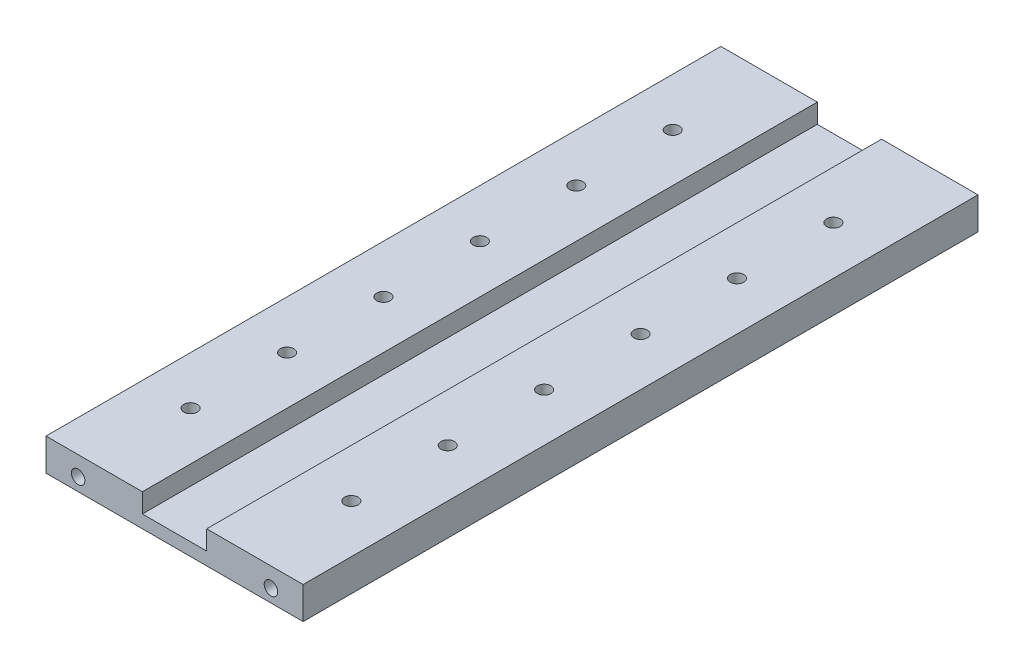
ISO-10303-21;
HEADER;
FILE_DESCRIPTION(('STEP AP214'),'2;1');
FILE_NAME('part.step','',(''),(''),'','','');
FILE_SCHEMA(('AUTOMOTIVE_DESIGN { 1 0 10303 214 1 1 1 1 }'));
ENDSEC;
DATA;
#1=APPLICATION_CONTEXT('core data for automotive mechanical design processes');
#2=APPLICATION_PROTOCOL_DEFINITION('international standard','automotive_design',2000,#1);
#3=PRODUCT_CONTEXT('',#1,'mechanical');
#4=PRODUCT('Part','Part','',(#3));
#5=PRODUCT_RELATED_PRODUCT_CATEGORY('part','',(#4));
#6=PRODUCT_DEFINITION_FORMATION('','',#4);
#7=PRODUCT_DEFINITION_CONTEXT('part definition',#1,'design');
#8=PRODUCT_DEFINITION('design','',#6,#7);
#9=PRODUCT_DEFINITION_SHAPE('','',#8);
#10=(LENGTH_UNIT() NAMED_UNIT(*) SI_UNIT(.MILLI.,.METRE.));
#11=(NAMED_UNIT(*) PLANE_ANGLE_UNIT() SI_UNIT($,.RADIAN.));
#12=(NAMED_UNIT(*) SI_UNIT($,.STERADIAN.) SOLID_ANGLE_UNIT());
#13=UNCERTAINTY_MEASURE_WITH_UNIT(LENGTH_MEASURE(1.E-05),#10,'distance_accuracy_value','');
#14=(GEOMETRIC_REPRESENTATION_CONTEXT(3) GLOBAL_UNCERTAINTY_ASSIGNED_CONTEXT((#13)) GLOBAL_UNIT_ASSIGNED_CONTEXT((#10,
#11,#12)) REPRESENTATION_CONTEXT('',''));
#15=CARTESIAN_POINT('',(0.,0.,0.));
#16=DIRECTION('',(0.,0.,1.));
#17=DIRECTION('',(1.,0.,0.));
#18=AXIS2_PLACEMENT_3D('',#15,#16,#17);
#19=CARTESIAN_POINT('',(-40.,10.,105.));
#20=DIRECTION('',(1.,0.,0.));
#21=DIRECTION('',(0.,0.,-1.));
#22=AXIS2_PLACEMENT_3D('',#19,#20,#21);
#23=PLANE('',#22);
#24=DIRECTION('',(0.,-1.,0.));
#25=VECTOR('',#24,1.);
#26=CARTESIAN_POINT('',(-40.,10.,-105.));
#27=LINE('',#26,#25);
#28=CARTESIAN_POINT('',(-40.,10.,-105.));
#29=VERTEX_POINT('',#28);
#30=CARTESIAN_POINT('',(-40.,0.,-105.));
#31=VERTEX_POINT('',#30);
#32=EDGE_CURVE('E137',#29,#31,#27,.T.);
#33=ORIENTED_EDGE('',*,*,#32,.T.);
#34=DIRECTION('',(0.,0.,-1.));
#35=VECTOR('',#34,1.);
#36=CARTESIAN_POINT('',(-40.,0.,105.));
#37=LINE('',#36,#35);
#38=CARTESIAN_POINT('',(-40.,0.,105.));
#39=VERTEX_POINT('',#38);
#40=EDGE_CURVE('E11',#39,#31,#37,.T.);
#41=ORIENTED_EDGE('',*,*,#40,.F.);
#42=DIRECTION('',(0.,-1.,0.));
#43=VECTOR('',#42,1.);
#44=CARTESIAN_POINT('',(-40.,10.,105.));
#45=LINE('',#44,#43);
#46=CARTESIAN_POINT('',(-40.,10.,105.));
#47=VERTEX_POINT('',#46);
#48=EDGE_CURVE('E152',#47,#39,#45,.T.);
#49=ORIENTED_EDGE('',*,*,#48,.F.);
#50=DIRECTION('',(0.,0.,-1.));
#51=VECTOR('',#50,1.);
#52=CARTESIAN_POINT('',(-40.,10.,105.));
#53=LINE('',#52,#51);
#54=EDGE_CURVE('E133',#47,#29,#53,.T.);
#55=ORIENTED_EDGE('',*,*,#54,.T.);
#56=EDGE_LOOP('',(#33,#41,#49,#55));
#57=FACE_BOUND('',#56,.T.);
#58=ADVANCED_FACE('F38',(#57),#23,.F.);
#59=CARTESIAN_POINT('',(-40.,0.,105.));
#60=DIRECTION('',(0.,1.,0.));
#61=DIRECTION('',(-1.,0.,0.));
#62=AXIS2_PLACEMENT_3D('',#59,#60,#61);
#63=PLANE('',#62);
#64=CARTESIAN_POINT('',(-25.,0.,75.));
#65=DIRECTION('',(0.,1.,0.));
#66=DIRECTION('',(0.,0.,1.));
#67=AXIS2_PLACEMENT_3D('',#64,#65,#66);
#68=CIRCLE('',#67,2.1);
#69=CARTESIAN_POINT('',(-25.,0.,77.1));
#70=VERTEX_POINT('',#69);
#71=EDGE_CURVE('E274',#70,#70,#68,.T.);
#72=ORIENTED_EDGE('',*,*,#71,.T.);
#73=EDGE_LOOP('',(#72));
#74=FACE_BOUND('',#73,.T.);
#75=CARTESIAN_POINT('',(-25.,0.,45.));
#76=DIRECTION('',(0.,1.,0.));
#77=DIRECTION('',(0.,0.,1.));
#78=AXIS2_PLACEMENT_3D('',#75,#76,#77);
#79=CIRCLE('',#78,2.1);
#80=CARTESIAN_POINT('',(-25.,0.,47.1));
#81=VERTEX_POINT('',#80);
#82=EDGE_CURVE('E268',#81,#81,#79,.T.);
#83=ORIENTED_EDGE('',*,*,#82,.T.);
#84=EDGE_LOOP('',(#83));
#85=FACE_BOUND('',#84,.T.);
#86=CARTESIAN_POINT('',(-25.,0.,15.));
#87=DIRECTION('',(0.,1.,0.));
#88=DIRECTION('',(0.,0.,1.));
#89=AXIS2_PLACEMENT_3D('',#86,#87,#88);
#90=CIRCLE('',#89,2.1);
#91=CARTESIAN_POINT('',(-25.,0.,17.1));
#92=VERTEX_POINT('',#91);
#93=EDGE_CURVE('E262',#92,#92,#90,.T.);
#94=ORIENTED_EDGE('',*,*,#93,.T.);
#95=EDGE_LOOP('',(#94));
#96=FACE_BOUND('',#95,.T.);
#97=CARTESIAN_POINT('',(-25.,0.,-15.));
#98=DIRECTION('',(0.,1.,0.));
#99=DIRECTION('',(0.,0.,1.));
#100=AXIS2_PLACEMENT_3D('',#97,#98,#99);
#101=CIRCLE('',#100,2.1);
#102=CARTESIAN_POINT('',(-25.,0.,-12.9));
#103=VERTEX_POINT('',#102);
#104=EDGE_CURVE('E256',#103,#103,#101,.T.);
#105=ORIENTED_EDGE('',*,*,#104,.T.);
#106=EDGE_LOOP('',(#105));
#107=FACE_BOUND('',#106,.T.);
#108=CARTESIAN_POINT('',(-25.,0.,-45.));
#109=DIRECTION('',(0.,1.,0.));
#110=DIRECTION('',(0.,0.,1.));
#111=AXIS2_PLACEMENT_3D('',#108,#109,#110);
#112=CIRCLE('',#111,2.1);
#113=CARTESIAN_POINT('',(-25.,0.,-42.9));
#114=VERTEX_POINT('',#113);
#115=EDGE_CURVE('E250',#114,#114,#112,.T.);
#116=ORIENTED_EDGE('',*,*,#115,.T.);
#117=EDGE_LOOP('',(#116));
#118=FACE_BOUND('',#117,.T.);
#119=CARTESIAN_POINT('',(-25.,0.,-75.));
#120=DIRECTION('',(0.,1.,0.));
#121=DIRECTION('',(0.,0.,1.));
#122=AXIS2_PLACEMENT_3D('',#119,#120,#121);
#123=CIRCLE('',#122,2.1);
#124=CARTESIAN_POINT('',(-25.,0.,-72.9));
#125=VERTEX_POINT('',#124);
#126=EDGE_CURVE('E244',#125,#125,#123,.T.);
#127=ORIENTED_EDGE('',*,*,#126,.T.);
#128=EDGE_LOOP('',(#127));
#129=FACE_BOUND('',#128,.T.);
#130=CARTESIAN_POINT('',(25.,0.,-75.));
#131=DIRECTION('',(0.,1.,0.));
#132=DIRECTION('',(0.,0.,1.));
#133=AXIS2_PLACEMENT_3D('',#130,#131,#132);
#134=CIRCLE('',#133,2.1);
#135=CARTESIAN_POINT('',(25.,0.,-72.9));
#136=VERTEX_POINT('',#135);
#137=EDGE_CURVE('E238',#136,#136,#134,.T.);
#138=ORIENTED_EDGE('',*,*,#137,.T.);
#139=EDGE_LOOP('',(#138));
#140=FACE_BOUND('',#139,.T.);
#141=CARTESIAN_POINT('',(25.,0.,-45.));
#142=DIRECTION('',(0.,1.,0.));
#143=DIRECTION('',(0.,0.,1.));
#144=AXIS2_PLACEMENT_3D('',#141,#142,#143);
#145=CIRCLE('',#144,2.1);
#146=CARTESIAN_POINT('',(25.,0.,-42.9));
#147=VERTEX_POINT('',#146);
#148=EDGE_CURVE('E232',#147,#147,#145,.T.);
#149=ORIENTED_EDGE('',*,*,#148,.T.);
#150=EDGE_LOOP('',(#149));
#151=FACE_BOUND('',#150,.T.);
#152=CARTESIAN_POINT('',(25.,0.,-15.));
#153=DIRECTION('',(0.,1.,0.));
#154=DIRECTION('',(0.,0.,1.));
#155=AXIS2_PLACEMENT_3D('',#152,#153,#154);
#156=CIRCLE('',#155,2.1);
#157=CARTESIAN_POINT('',(25.,0.,-12.9));
#158=VERTEX_POINT('',#157);
#159=EDGE_CURVE('E226',#158,#158,#156,.T.);
#160=ORIENTED_EDGE('',*,*,#159,.T.);
#161=EDGE_LOOP('',(#160));
#162=FACE_BOUND('',#161,.T.);
#163=CARTESIAN_POINT('',(25.,0.,15.));
#164=DIRECTION('',(0.,1.,0.));
#165=DIRECTION('',(0.,0.,1.));
#166=AXIS2_PLACEMENT_3D('',#163,#164,#165);
#167=CIRCLE('',#166,2.1);
#168=CARTESIAN_POINT('',(25.,0.,17.1));
#169=VERTEX_POINT('',#168);
#170=EDGE_CURVE('E220',#169,#169,#167,.T.);
#171=ORIENTED_EDGE('',*,*,#170,.T.);
#172=EDGE_LOOP('',(#171));
#173=FACE_BOUND('',#172,.T.);
#174=CARTESIAN_POINT('',(25.,0.,45.));
#175=DIRECTION('',(0.,1.,0.));
#176=DIRECTION('',(0.,0.,1.));
#177=AXIS2_PLACEMENT_3D('',#174,#175,#176);
#178=CIRCLE('',#177,2.1);
#179=CARTESIAN_POINT('',(25.,0.,47.1));
#180=VERTEX_POINT('',#179);
#181=EDGE_CURVE('E214',#180,#180,#178,.T.);
#182=ORIENTED_EDGE('',*,*,#181,.T.);
#183=EDGE_LOOP('',(#182));
#184=FACE_BOUND('',#183,.T.);
#185=CARTESIAN_POINT('',(25.,0.,75.));
#186=DIRECTION('',(0.,1.,0.));
#187=DIRECTION('',(0.,0.,1.));
#188=AXIS2_PLACEMENT_3D('',#185,#186,#187);
#189=CIRCLE('',#188,2.1);
#190=CARTESIAN_POINT('',(25.,0.,77.1));
#191=VERTEX_POINT('',#190);
#192=EDGE_CURVE('E208',#191,#191,#189,.T.);
#193=ORIENTED_EDGE('',*,*,#192,.T.);
#194=EDGE_LOOP('',(#193));
#195=FACE_BOUND('',#194,.T.);
#196=DIRECTION('',(1.,0.,0.));
#197=VECTOR('',#196,1.);
#198=CARTESIAN_POINT('',(-40.,0.,-105.));
#199=LINE('',#198,#197);
#200=CARTESIAN_POINT('',(40.,0.,-105.));
#201=VERTEX_POINT('',#200);
#202=EDGE_CURVE('E140',#31,#201,#199,.T.);
#203=ORIENTED_EDGE('',*,*,#202,.T.);
#204=DIRECTION('',(0.,0.,-1.));
#205=VECTOR('',#204,1.);
#206=CARTESIAN_POINT('',(40.,0.,105.));
#207=LINE('',#206,#205);
#208=CARTESIAN_POINT('',(40.,0.,105.));
#209=VERTEX_POINT('',#208);
#210=EDGE_CURVE('E46',#209,#201,#207,.T.);
#211=ORIENTED_EDGE('',*,*,#210,.F.);
#212=DIRECTION('',(1.,0.,0.));
#213=VECTOR('',#212,1.);
#214=CARTESIAN_POINT('',(-40.,0.,105.));
#215=LINE('',#214,#213);
#216=EDGE_CURVE('E98',#39,#209,#215,.T.);
#217=ORIENTED_EDGE('',*,*,#216,.F.);
#218=ORIENTED_EDGE('',*,*,#40,.T.);
#219=EDGE_LOOP('',(#203,#211,#217,#218));
#220=FACE_BOUND('',#219,.T.);
#221=ADVANCED_FACE('F315',(#74,#85,#96,#107,#118,#129,#140,#151,#162,#173,#184,#195,#220),#63,.F.);
#222=CARTESIAN_POINT('',(40.,0.,105.));
#223=DIRECTION('',(-1.,0.,0.));
#224=DIRECTION('',(0.,0.,1.));
#225=AXIS2_PLACEMENT_3D('',#222,#223,#224);
#226=PLANE('',#225);
#227=DIRECTION('',(0.,1.,0.));
#228=VECTOR('',#227,1.);
#229=CARTESIAN_POINT('',(40.,0.,-105.));
#230=LINE('',#229,#228);
#231=CARTESIAN_POINT('',(40.,10.,-105.));
#232=VERTEX_POINT('',#231);
#233=EDGE_CURVE('E143',#201,#232,#230,.T.);
#234=ORIENTED_EDGE('',*,*,#233,.T.);
#235=DIRECTION('',(0.,0.,-1.));
#236=VECTOR('',#235,1.);
#237=CARTESIAN_POINT('',(40.,10.,105.));
#238=LINE('',#237,#236);
#239=CARTESIAN_POINT('',(40.,10.,105.));
#240=VERTEX_POINT('',#239);
#241=EDGE_CURVE('E159',#240,#232,#238,.T.);
#242=ORIENTED_EDGE('',*,*,#241,.F.);
#243=DIRECTION('',(0.,1.,0.));
#244=VECTOR('',#243,1.);
#245=CARTESIAN_POINT('',(40.,0.,105.));
#246=LINE('',#245,#244);
#247=EDGE_CURVE('E167',#209,#240,#246,.T.);
#248=ORIENTED_EDGE('',*,*,#247,.F.);
#249=ORIENTED_EDGE('',*,*,#210,.T.);
#250=EDGE_LOOP('',(#234,#242,#248,#249));
#251=FACE_BOUND('',#250,.T.);
#252=ADVANCED_FACE('F165',(#251),#226,.F.);
#253=CARTESIAN_POINT('',(40.,10.,105.));
#254=DIRECTION('',(0.,-1.,0.));
#255=DIRECTION('',(1.,0.,0.));
#256=AXIS2_PLACEMENT_3D('',#253,#254,#255);
#257=PLANE('',#256);
#258=CARTESIAN_POINT('',(25.,10.,-75.));
#259=DIRECTION('',(0.,1.,0.));
#260=DIRECTION('',(0.,0.,1.));
#261=AXIS2_PLACEMENT_3D('',#258,#259,#260);
#262=CIRCLE('',#261,2.09999999999999);
#263=CARTESIAN_POINT('',(25.,10.,-72.9));
#264=VERTEX_POINT('',#263);
#265=EDGE_CURVE('E241',#264,#264,#262,.T.);
#266=ORIENTED_EDGE('',*,*,#265,.F.);
#267=EDGE_LOOP('',(#266));
#268=FACE_BOUND('',#267,.T.);
#269=CARTESIAN_POINT('',(25.,10.,-45.));
#270=DIRECTION('',(0.,1.,0.));
#271=DIRECTION('',(0.,0.,1.));
#272=AXIS2_PLACEMENT_3D('',#269,#270,#271);
#273=CIRCLE('',#272,2.09999999999999);
#274=CARTESIAN_POINT('',(25.,10.,-42.9));
#275=VERTEX_POINT('',#274);
#276=EDGE_CURVE('E235',#275,#275,#273,.T.);
#277=ORIENTED_EDGE('',*,*,#276,.F.);
#278=EDGE_LOOP('',(#277));
#279=FACE_BOUND('',#278,.T.);
#280=CARTESIAN_POINT('',(25.,10.,-15.));
#281=DIRECTION('',(0.,1.,0.));
#282=DIRECTION('',(0.,0.,1.));
#283=AXIS2_PLACEMENT_3D('',#280,#281,#282);
#284=CIRCLE('',#283,2.09999999999999);
#285=CARTESIAN_POINT('',(25.,10.,-12.9));
#286=VERTEX_POINT('',#285);
#287=EDGE_CURVE('E229',#286,#286,#284,.T.);
#288=ORIENTED_EDGE('',*,*,#287,.F.);
#289=EDGE_LOOP('',(#288));
#290=FACE_BOUND('',#289,.T.);
#291=CARTESIAN_POINT('',(25.,10.,15.));
#292=DIRECTION('',(0.,1.,0.));
#293=DIRECTION('',(0.,0.,1.));
#294=AXIS2_PLACEMENT_3D('',#291,#292,#293);
#295=CIRCLE('',#294,2.09999999999999);
#296=CARTESIAN_POINT('',(25.,10.,17.1));
#297=VERTEX_POINT('',#296);
#298=EDGE_CURVE('E223',#297,#297,#295,.T.);
#299=ORIENTED_EDGE('',*,*,#298,.F.);
#300=EDGE_LOOP('',(#299));
#301=FACE_BOUND('',#300,.T.);
#302=CARTESIAN_POINT('',(25.,10.,45.));
#303=DIRECTION('',(0.,1.,0.));
#304=DIRECTION('',(0.,0.,1.));
#305=AXIS2_PLACEMENT_3D('',#302,#303,#304);
#306=CIRCLE('',#305,2.09999999999999);
#307=CARTESIAN_POINT('',(25.,10.,47.1));
#308=VERTEX_POINT('',#307);
#309=EDGE_CURVE('E217',#308,#308,#306,.T.);
#310=ORIENTED_EDGE('',*,*,#309,.F.);
#311=EDGE_LOOP('',(#310));
#312=FACE_BOUND('',#311,.T.);
#313=CARTESIAN_POINT('',(25.,10.,75.));
#314=DIRECTION('',(0.,1.,0.));
#315=DIRECTION('',(0.,0.,1.));
#316=AXIS2_PLACEMENT_3D('',#313,#314,#315);
#317=CIRCLE('',#316,2.09999999999999);
#318=CARTESIAN_POINT('',(25.,10.,77.1));
#319=VERTEX_POINT('',#318);
#320=EDGE_CURVE('E211',#319,#319,#317,.T.);
#321=ORIENTED_EDGE('',*,*,#320,.F.);
#322=EDGE_LOOP('',(#321));
#323=FACE_BOUND('',#322,.T.);
#324=DIRECTION('',(-1.,0.,0.));
#325=VECTOR('',#324,1.);
#326=CARTESIAN_POINT('',(40.,10.,-105.));
#327=LINE('',#326,#325);
#328=CARTESIAN_POINT('',(10.,10.,-105.));
#329=VERTEX_POINT('',#328);
#330=EDGE_CURVE('E145',#232,#329,#327,.T.);
#331=ORIENTED_EDGE('',*,*,#330,.T.);
#332=DIRECTION('',(0.,0.,-1.));
#333=VECTOR('',#332,1.);
#334=CARTESIAN_POINT('',(10.,10.,105.));
#335=LINE('',#334,#333);
#336=CARTESIAN_POINT('',(10.,10.,105.));
#337=VERTEX_POINT('',#336);
#338=EDGE_CURVE('E156',#337,#329,#335,.T.);
#339=ORIENTED_EDGE('',*,*,#338,.F.);
#340=DIRECTION('',(-1.,0.,0.));
#341=VECTOR('',#340,1.);
#342=CARTESIAN_POINT('',(40.,10.,105.));
#343=LINE('',#342,#341);
#344=EDGE_CURVE('E179',#240,#337,#343,.T.);
#345=ORIENTED_EDGE('',*,*,#344,.F.);
#346=ORIENTED_EDGE('',*,*,#241,.T.);
#347=EDGE_LOOP('',(#331,#339,#345,#346));
#348=FACE_BOUND('',#347,.T.);
#349=ADVANCED_FACE('F175',(#268,#279,#290,#301,#312,#323,#348),#257,.F.);
#350=CARTESIAN_POINT('',(10.,10.,105.));
#351=DIRECTION('',(1.,0.,0.));
#352=DIRECTION('',(0.,1.,0.));
#353=AXIS2_PLACEMENT_3D('',#350,#351,#352);
#354=PLANE('',#353);
#355=DIRECTION('',(0.,-1.,0.));
#356=VECTOR('',#355,1.);
#357=CARTESIAN_POINT('',(10.,10.,-105.));
#358=LINE('',#357,#356);
#359=CARTESIAN_POINT('',(10.,4.,-105.));
#360=VERTEX_POINT('',#359);
#361=EDGE_CURVE('E147',#329,#360,#358,.T.);
#362=ORIENTED_EDGE('',*,*,#361,.T.);
#363=DIRECTION('',(0.,0.,-1.));
#364=VECTOR('',#363,1.);
#365=CARTESIAN_POINT('',(10.,4.,105.));
#366=LINE('',#365,#364);
#367=CARTESIAN_POINT('',(10.,4.,105.));
#368=VERTEX_POINT('',#367);
#369=EDGE_CURVE('E128',#368,#360,#366,.T.);
#370=ORIENTED_EDGE('',*,*,#369,.F.);
#371=DIRECTION('',(0.,-1.,0.));
#372=VECTOR('',#371,1.);
#373=CARTESIAN_POINT('',(10.,10.,105.));
#374=LINE('',#373,#372);
#375=EDGE_CURVE('E119',#337,#368,#374,.T.);
#376=ORIENTED_EDGE('',*,*,#375,.F.);
#377=ORIENTED_EDGE('',*,*,#338,.T.);
#378=EDGE_LOOP('',(#362,#370,#376,#377));
#379=FACE_BOUND('',#378,.T.);
#380=ADVANCED_FACE('F178',(#379),#354,.F.);
#381=CARTESIAN_POINT('',(10.,4.,105.));
#382=DIRECTION('',(0.,-1.,0.));
#383=DIRECTION('',(0.,0.,-1.));
#384=AXIS2_PLACEMENT_3D('',#381,#382,#383);
#385=PLANE('',#384);
#386=DIRECTION('',(-1.,0.,0.));
#387=VECTOR('',#386,1.);
#388=CARTESIAN_POINT('',(10.,4.,-105.));
#389=LINE('',#388,#387);
#390=CARTESIAN_POINT('',(-10.,4.,-105.));
#391=VERTEX_POINT('',#390);
#392=EDGE_CURVE('E127',#360,#391,#389,.T.);
#393=ORIENTED_EDGE('',*,*,#392,.T.);
#394=DIRECTION('',(0.,0.,-1.));
#395=VECTOR('',#394,1.);
#396=CARTESIAN_POINT('',(-10.,4.,105.));
#397=LINE('',#396,#395);
#398=CARTESIAN_POINT('',(-10.,4.,105.));
#399=VERTEX_POINT('',#398);
#400=EDGE_CURVE('E124',#399,#391,#397,.T.);
#401=ORIENTED_EDGE('',*,*,#400,.F.);
#402=DIRECTION('',(-1.,0.,0.));
#403=VECTOR('',#402,1.);
#404=CARTESIAN_POINT('',(10.,4.,105.));
#405=LINE('',#404,#403);
#406=EDGE_CURVE('E113',#368,#399,#405,.T.);
#407=ORIENTED_EDGE('',*,*,#406,.F.);
#408=ORIENTED_EDGE('',*,*,#369,.T.);
#409=EDGE_LOOP('',(#393,#401,#407,#408));
#410=FACE_BOUND('',#409,.T.);
#411=ADVANCED_FACE('F125',(#410),#385,.F.);
#412=CARTESIAN_POINT('',(-10.,4.,105.));
#413=DIRECTION('',(-1.,0.,0.));
#414=DIRECTION('',(0.,-1.,0.));
#415=AXIS2_PLACEMENT_3D('',#412,#413,#414);
#416=PLANE('',#415);
#417=DIRECTION('',(0.,1.,0.));
#418=VECTOR('',#417,1.);
#419=CARTESIAN_POINT('',(-10.,4.,-105.));
#420=LINE('',#419,#418);
#421=CARTESIAN_POINT('',(-10.,10.,-105.));
#422=VERTEX_POINT('',#421);
#423=EDGE_CURVE('E84',#391,#422,#420,.T.);
#424=ORIENTED_EDGE('',*,*,#423,.T.);
#425=DIRECTION('',(0.,0.,-1.));
#426=VECTOR('',#425,1.);
#427=CARTESIAN_POINT('',(-10.,10.,105.));
#428=LINE('',#427,#426);
#429=CARTESIAN_POINT('',(-10.,10.,105.));
#430=VERTEX_POINT('',#429);
#431=EDGE_CURVE('E129',#430,#422,#428,.T.);
#432=ORIENTED_EDGE('',*,*,#431,.F.);
#433=DIRECTION('',(0.,1.,0.));
#434=VECTOR('',#433,1.);
#435=CARTESIAN_POINT('',(-10.,4.,105.));
#436=LINE('',#435,#434);
#437=EDGE_CURVE('E117',#399,#430,#436,.T.);
#438=ORIENTED_EDGE('',*,*,#437,.F.);
#439=ORIENTED_EDGE('',*,*,#400,.T.);
#440=EDGE_LOOP('',(#424,#432,#438,#439));
#441=FACE_BOUND('',#440,.T.);
#442=ADVANCED_FACE('F131',(#441),#416,.F.);
#443=CARTESIAN_POINT('',(-10.,10.,105.));
#444=DIRECTION('',(0.,-1.,0.));
#445=DIRECTION('',(1.,0.,0.));
#446=AXIS2_PLACEMENT_3D('',#443,#444,#445);
#447=PLANE('',#446);
#448=CARTESIAN_POINT('',(-25.,10.,75.));
#449=DIRECTION('',(0.,1.,0.));
#450=DIRECTION('',(0.,0.,1.));
#451=AXIS2_PLACEMENT_3D('',#448,#449,#450);
#452=CIRCLE('',#451,2.09999999999999);
#453=CARTESIAN_POINT('',(-25.,10.,77.1));
#454=VERTEX_POINT('',#453);
#455=EDGE_CURVE('E277',#454,#454,#452,.T.);
#456=ORIENTED_EDGE('',*,*,#455,.F.);
#457=EDGE_LOOP('',(#456));
#458=FACE_BOUND('',#457,.T.);
#459=CARTESIAN_POINT('',(-25.,10.,45.));
#460=DIRECTION('',(0.,1.,0.));
#461=DIRECTION('',(0.,0.,1.));
#462=AXIS2_PLACEMENT_3D('',#459,#460,#461);
#463=CIRCLE('',#462,2.09999999999999);
#464=CARTESIAN_POINT('',(-25.,10.,47.1));
#465=VERTEX_POINT('',#464);
#466=EDGE_CURVE('E271',#465,#465,#463,.T.);
#467=ORIENTED_EDGE('',*,*,#466,.F.);
#468=EDGE_LOOP('',(#467));
#469=FACE_BOUND('',#468,.T.);
#470=CARTESIAN_POINT('',(-25.,10.,15.));
#471=DIRECTION('',(0.,1.,0.));
#472=DIRECTION('',(0.,0.,1.));
#473=AXIS2_PLACEMENT_3D('',#470,#471,#472);
#474=CIRCLE('',#473,2.09999999999999);
#475=CARTESIAN_POINT('',(-25.,10.,17.1));
#476=VERTEX_POINT('',#475);
#477=EDGE_CURVE('E265',#476,#476,#474,.T.);
#478=ORIENTED_EDGE('',*,*,#477,.F.);
#479=EDGE_LOOP('',(#478));
#480=FACE_BOUND('',#479,.T.);
#481=CARTESIAN_POINT('',(-25.,10.,-15.));
#482=DIRECTION('',(0.,1.,0.));
#483=DIRECTION('',(0.,0.,1.));
#484=AXIS2_PLACEMENT_3D('',#481,#482,#483);
#485=CIRCLE('',#484,2.09999999999999);
#486=CARTESIAN_POINT('',(-25.,10.,-12.9));
#487=VERTEX_POINT('',#486);
#488=EDGE_CURVE('E259',#487,#487,#485,.T.);
#489=ORIENTED_EDGE('',*,*,#488,.F.);
#490=EDGE_LOOP('',(#489));
#491=FACE_BOUND('',#490,.T.);
#492=CARTESIAN_POINT('',(-25.,10.,-45.));
#493=DIRECTION('',(0.,1.,0.));
#494=DIRECTION('',(0.,0.,1.));
#495=AXIS2_PLACEMENT_3D('',#492,#493,#494);
#496=CIRCLE('',#495,2.09999999999999);
#497=CARTESIAN_POINT('',(-25.,10.,-42.9));
#498=VERTEX_POINT('',#497);
#499=EDGE_CURVE('E253',#498,#498,#496,.T.);
#500=ORIENTED_EDGE('',*,*,#499,.F.);
#501=EDGE_LOOP('',(#500));
#502=FACE_BOUND('',#501,.T.);
#503=CARTESIAN_POINT('',(-25.,10.,-75.));
#504=DIRECTION('',(0.,1.,0.));
#505=DIRECTION('',(0.,0.,1.));
#506=AXIS2_PLACEMENT_3D('',#503,#504,#505);
#507=CIRCLE('',#506,2.09999999999999);
#508=CARTESIAN_POINT('',(-25.,10.,-72.9));
#509=VERTEX_POINT('',#508);
#510=EDGE_CURVE('E247',#509,#509,#507,.T.);
#511=ORIENTED_EDGE('',*,*,#510,.F.);
#512=EDGE_LOOP('',(#511));
#513=FACE_BOUND('',#512,.T.);
#514=DIRECTION('',(-1.,0.,0.));
#515=VECTOR('',#514,1.);
#516=CARTESIAN_POINT('',(-10.,10.,-105.));
#517=LINE('',#516,#515);
#518=EDGE_CURVE('E90',#422,#29,#517,.T.);
#519=ORIENTED_EDGE('',*,*,#518,.T.);
#520=ORIENTED_EDGE('',*,*,#54,.F.);
#521=DIRECTION('',(-1.,0.,0.));
#522=VECTOR('',#521,1.);
#523=CARTESIAN_POINT('',(-10.,10.,105.));
#524=LINE('',#523,#522);
#525=EDGE_CURVE('E54',#430,#47,#524,.T.);
#526=ORIENTED_EDGE('',*,*,#525,.F.);
#527=ORIENTED_EDGE('',*,*,#431,.T.);
#528=EDGE_LOOP('',(#519,#520,#526,#527));
#529=FACE_BOUND('',#528,.T.);
#530=ADVANCED_FACE('F283',(#458,#469,#480,#491,#502,#513,#529),#447,.F.);
#531=CARTESIAN_POINT('',(0.,0.,105.));
#532=DIRECTION('',(0.,0.,1.));
#533=DIRECTION('',(1.,0.,0.));
#534=AXIS2_PLACEMENT_3D('',#531,#532,#533);
#535=PLANE('',#534);
#536=CARTESIAN_POINT('',(-30.,3.99999999999999,105.));
#537=DIRECTION('',(0.,0.,1.));
#538=DIRECTION('',(1.,0.,0.));
#539=AXIS2_PLACEMENT_3D('',#536,#537,#538);
#540=CIRCLE('',#539,2.09999999999999);
#541=CARTESIAN_POINT('',(-27.9,3.99999999999999,105.));
#542=VERTEX_POINT('',#541);
#543=EDGE_CURVE('E193',#542,#542,#540,.T.);
#544=ORIENTED_EDGE('',*,*,#543,.F.);
#545=EDGE_LOOP('',(#544));
#546=FACE_BOUND('',#545,.T.);
#547=CARTESIAN_POINT('',(30.,3.99999999999999,105.));
#548=DIRECTION('',(0.,0.,1.));
#549=DIRECTION('',(1.,0.,0.));
#550=AXIS2_PLACEMENT_3D('',#547,#548,#549);
#551=CIRCLE('',#550,2.09999999999999);
#552=CARTESIAN_POINT('',(32.1,3.99999999999999,105.));
#553=VERTEX_POINT('',#552);
#554=EDGE_CURVE('E187',#553,#553,#551,.T.);
#555=ORIENTED_EDGE('',*,*,#554,.F.);
#556=EDGE_LOOP('',(#555));
#557=FACE_BOUND('',#556,.T.);
#558=ORIENTED_EDGE('',*,*,#48,.T.);
#559=ORIENTED_EDGE('',*,*,#216,.T.);
#560=ORIENTED_EDGE('',*,*,#247,.T.);
#561=ORIENTED_EDGE('',*,*,#344,.T.);
#562=ORIENTED_EDGE('',*,*,#375,.T.);
#563=ORIENTED_EDGE('',*,*,#406,.T.);
#564=ORIENTED_EDGE('',*,*,#437,.T.);
#565=ORIENTED_EDGE('',*,*,#525,.T.);
#566=EDGE_LOOP('',(#558,#559,#560,#561,#562,#563,#564,#565));
#567=FACE_BOUND('',#566,.T.);
#568=ADVANCED_FACE('F115',(#546,#557,#567),#535,.T.);
#569=CARTESIAN_POINT('',(0.,0.,-105.));
#570=DIRECTION('',(0.,0.,1.));
#571=DIRECTION('',(1.,0.,0.));
#572=AXIS2_PLACEMENT_3D('',#569,#570,#571);
#573=PLANE('',#572);
#574=CARTESIAN_POINT('',(25.,5.,-105.));
#575=DIRECTION('',(0.,0.,-1.));
#576=DIRECTION('',(-1.,0.,0.));
#577=AXIS2_PLACEMENT_3D('',#574,#575,#576);
#578=CIRCLE('',#577,2.09999999999999);
#579=CARTESIAN_POINT('',(22.9,5.,-105.));
#580=VERTEX_POINT('',#579);
#581=EDGE_CURVE('E205',#580,#580,#578,.T.);
#582=ORIENTED_EDGE('',*,*,#581,.F.);
#583=EDGE_LOOP('',(#582));
#584=FACE_BOUND('',#583,.T.);
#585=CARTESIAN_POINT('',(-25.,5.,-105.));
#586=DIRECTION('',(0.,0.,-1.));
#587=DIRECTION('',(-1.,0.,0.));
#588=AXIS2_PLACEMENT_3D('',#585,#586,#587);
#589=CIRCLE('',#588,2.09999999999999);
#590=CARTESIAN_POINT('',(-27.1,5.,-105.));
#591=VERTEX_POINT('',#590);
#592=EDGE_CURVE('E199',#591,#591,#589,.T.);
#593=ORIENTED_EDGE('',*,*,#592,.F.);
#594=EDGE_LOOP('',(#593));
#595=FACE_BOUND('',#594,.T.);
#596=ORIENTED_EDGE('',*,*,#32,.F.);
#597=ORIENTED_EDGE('',*,*,#518,.F.);
#598=ORIENTED_EDGE('',*,*,#423,.F.);
#599=ORIENTED_EDGE('',*,*,#392,.F.);
#600=ORIENTED_EDGE('',*,*,#361,.F.);
#601=ORIENTED_EDGE('',*,*,#330,.F.);
#602=ORIENTED_EDGE('',*,*,#233,.F.);
#603=ORIENTED_EDGE('',*,*,#202,.F.);
#604=EDGE_LOOP('',(#596,#597,#598,#599,#600,#601,#602,#603));
#605=FACE_BOUND('',#604,.T.);
#606=ADVANCED_FACE('F171',(#584,#595,#605),#573,.F.);
#607=CARTESIAN_POINT('',(30.,3.99999999999999,91.));
#608=DIRECTION('',(0.,0.,1.));
#609=DIRECTION('',(1.,0.,0.));
#610=AXIS2_PLACEMENT_3D('',#607,#608,#609);
#611=CONICAL_SURFACE('',#610,2.09999999999999,1.02974425867665);
#612=CARTESIAN_POINT('',(30.,3.99999999999999,89.7381927000421));
#613=VERTEX_POINT('',#612);
#614=VERTEX_LOOP('',#613);
#615=FACE_BOUND('',#614,.T.);
#616=CARTESIAN_POINT('',(30.,3.99999999999999,91.));
#617=DIRECTION('',(0.,0.,1.));
#618=DIRECTION('',(1.,0.,0.));
#619=AXIS2_PLACEMENT_3D('',#616,#617,#618);
#620=CIRCLE('',#619,2.09999999999999);
#621=CARTESIAN_POINT('',(32.1,3.99999999999999,91.));
#622=VERTEX_POINT('',#621);
#623=EDGE_CURVE('E141',#622,#622,#620,.T.);
#624=ORIENTED_EDGE('',*,*,#623,.T.);
#625=EDGE_LOOP('',(#624));
#626=FACE_BOUND('',#625,.T.);
#627=ADVANCED_FACE('F340',(#615,#626),#611,.F.);
#628=CARTESIAN_POINT('',(30.,3.99999999999999,105.));
#629=DIRECTION('',(0.,0.,1.));
#630=DIRECTION('',(1.,0.,0.));
#631=AXIS2_PLACEMENT_3D('',#628,#629,#630);
#632=CYLINDRICAL_SURFACE('',#631,2.09999999999999);
#633=ORIENTED_EDGE('',*,*,#623,.F.);
#634=EDGE_LOOP('',(#633));
#635=FACE_BOUND('',#634,.T.);
#636=ORIENTED_EDGE('',*,*,#554,.T.);
#637=EDGE_LOOP('',(#636));
#638=FACE_BOUND('',#637,.T.);
#639=ADVANCED_FACE('F347',(#635,#638),#632,.F.);
#640=CARTESIAN_POINT('',(-30.,3.99999999999999,91.));
#641=DIRECTION('',(0.,0.,1.));
#642=DIRECTION('',(1.,0.,0.));
#643=AXIS2_PLACEMENT_3D('',#640,#641,#642);
#644=CONICAL_SURFACE('',#643,2.09999999999999,1.02974425867665);
#645=CARTESIAN_POINT('',(-30.,3.99999999999999,89.7381927000421));
#646=VERTEX_POINT('',#645);
#647=VERTEX_LOOP('',#646);
#648=FACE_BOUND('',#647,.T.);
#649=CARTESIAN_POINT('',(-30.,3.99999999999999,91.));
#650=DIRECTION('',(0.,0.,1.));
#651=DIRECTION('',(1.,0.,0.));
#652=AXIS2_PLACEMENT_3D('',#649,#650,#651);
#653=CIRCLE('',#652,2.09999999999999);
#654=CARTESIAN_POINT('',(-27.9,3.99999999999999,91.));
#655=VERTEX_POINT('',#654);
#656=EDGE_CURVE('E190',#655,#655,#653,.T.);
#657=ORIENTED_EDGE('',*,*,#656,.T.);
#658=EDGE_LOOP('',(#657));
#659=FACE_BOUND('',#658,.T.);
#660=ADVANCED_FACE('F351',(#648,#659),#644,.F.);
#661=CARTESIAN_POINT('',(-30.,3.99999999999999,105.));
#662=DIRECTION('',(0.,0.,1.));
#663=DIRECTION('',(1.,0.,0.));
#664=AXIS2_PLACEMENT_3D('',#661,#662,#663);
#665=CYLINDRICAL_SURFACE('',#664,2.09999999999999);
#666=ORIENTED_EDGE('',*,*,#656,.F.);
#667=EDGE_LOOP('',(#666));
#668=FACE_BOUND('',#667,.T.);
#669=ORIENTED_EDGE('',*,*,#543,.T.);
#670=EDGE_LOOP('',(#669));
#671=FACE_BOUND('',#670,.T.);
#672=ADVANCED_FACE('F355',(#668,#671),#665,.F.);
#673=CARTESIAN_POINT('',(-25.,5.,-91.));
#674=DIRECTION('',(0.,0.,-1.));
#675=DIRECTION('',(-1.,0.,0.));
#676=AXIS2_PLACEMENT_3D('',#673,#674,#675);
#677=CONICAL_SURFACE('',#676,2.09999999999999,1.02974425867665);
#678=CARTESIAN_POINT('',(-25.,5.,-89.7381927000421));
#679=VERTEX_POINT('',#678);
#680=VERTEX_LOOP('',#679);
#681=FACE_BOUND('',#680,.T.);
#682=CARTESIAN_POINT('',(-25.,5.,-91.));
#683=DIRECTION('',(0.,0.,-1.));
#684=DIRECTION('',(-1.,0.,0.));
#685=AXIS2_PLACEMENT_3D('',#682,#683,#684);
#686=CIRCLE('',#685,2.09999999999999);
#687=CARTESIAN_POINT('',(-27.1,5.,-91.));
#688=VERTEX_POINT('',#687);
#689=EDGE_CURVE('E196',#688,#688,#686,.T.);
#690=ORIENTED_EDGE('',*,*,#689,.T.);
#691=EDGE_LOOP('',(#690));
#692=FACE_BOUND('',#691,.T.);
#693=ADVANCED_FACE('F359',(#681,#692),#677,.F.);
#694=CARTESIAN_POINT('',(-25.,5.,-105.));
#695=DIRECTION('',(0.,0.,-1.));
#696=DIRECTION('',(-1.,0.,0.));
#697=AXIS2_PLACEMENT_3D('',#694,#695,#696);
#698=CYLINDRICAL_SURFACE('',#697,2.09999999999999);
#699=ORIENTED_EDGE('',*,*,#689,.F.);
#700=EDGE_LOOP('',(#699));
#701=FACE_BOUND('',#700,.T.);
#702=ORIENTED_EDGE('',*,*,#592,.T.);
#703=EDGE_LOOP('',(#702));
#704=FACE_BOUND('',#703,.T.);
#705=ADVANCED_FACE('F363',(#701,#704),#698,.F.);
#706=CARTESIAN_POINT('',(25.,5.,-91.));
#707=DIRECTION('',(0.,0.,-1.));
#708=DIRECTION('',(-1.,0.,0.));
#709=AXIS2_PLACEMENT_3D('',#706,#707,#708);
#710=CONICAL_SURFACE('',#709,2.09999999999999,1.02974425867665);
#711=CARTESIAN_POINT('',(25.,5.,-89.7381927000421));
#712=VERTEX_POINT('',#711);
#713=VERTEX_LOOP('',#712);
#714=FACE_BOUND('',#713,.T.);
#715=CARTESIAN_POINT('',(25.,5.,-91.));
#716=DIRECTION('',(0.,0.,-1.));
#717=DIRECTION('',(-1.,0.,0.));
#718=AXIS2_PLACEMENT_3D('',#715,#716,#717);
#719=CIRCLE('',#718,2.09999999999999);
#720=CARTESIAN_POINT('',(22.9,5.,-91.));
#721=VERTEX_POINT('',#720);
#722=EDGE_CURVE('E202',#721,#721,#719,.T.);
#723=ORIENTED_EDGE('',*,*,#722,.T.);
#724=EDGE_LOOP('',(#723));
#725=FACE_BOUND('',#724,.T.);
#726=ADVANCED_FACE('F367',(#714,#725),#710,.F.);
#727=CARTESIAN_POINT('',(25.,5.,-105.));
#728=DIRECTION('',(0.,0.,-1.));
#729=DIRECTION('',(-1.,0.,0.));
#730=AXIS2_PLACEMENT_3D('',#727,#728,#729);
#731=CYLINDRICAL_SURFACE('',#730,2.09999999999999);
#732=ORIENTED_EDGE('',*,*,#722,.F.);
#733=EDGE_LOOP('',(#732));
#734=FACE_BOUND('',#733,.T.);
#735=ORIENTED_EDGE('',*,*,#581,.T.);
#736=EDGE_LOOP('',(#735));
#737=FACE_BOUND('',#736,.T.);
#738=ADVANCED_FACE('F371',(#734,#737),#731,.F.);
#739=CARTESIAN_POINT('',(25.,10.,75.));
#740=DIRECTION('',(0.,1.,0.));
#741=DIRECTION('',(0.,0.,1.));
#742=AXIS2_PLACEMENT_3D('',#739,#740,#741);
#743=CYLINDRICAL_SURFACE('',#742,2.09999999999999);
#744=ORIENTED_EDGE('',*,*,#192,.F.);
#745=EDGE_LOOP('',(#744));
#746=FACE_BOUND('',#745,.T.);
#747=ORIENTED_EDGE('',*,*,#320,.T.);
#748=EDGE_LOOP('',(#747));
#749=FACE_BOUND('',#748,.T.);
#750=ADVANCED_FACE('F375',(#746,#749),#743,.F.);
#751=CARTESIAN_POINT('',(25.,10.,45.));
#752=DIRECTION('',(0.,1.,0.));
#753=DIRECTION('',(0.,0.,1.));
#754=AXIS2_PLACEMENT_3D('',#751,#752,#753);
#755=CYLINDRICAL_SURFACE('',#754,2.09999999999999);
#756=ORIENTED_EDGE('',*,*,#181,.F.);
#757=EDGE_LOOP('',(#756));
#758=FACE_BOUND('',#757,.T.);
#759=ORIENTED_EDGE('',*,*,#309,.T.);
#760=EDGE_LOOP('',(#759));
#761=FACE_BOUND('',#760,.T.);
#762=ADVANCED_FACE('F379',(#758,#761),#755,.F.);
#763=CARTESIAN_POINT('',(25.,10.,15.));
#764=DIRECTION('',(0.,1.,0.));
#765=DIRECTION('',(0.,0.,1.));
#766=AXIS2_PLACEMENT_3D('',#763,#764,#765);
#767=CYLINDRICAL_SURFACE('',#766,2.09999999999999);
#768=ORIENTED_EDGE('',*,*,#170,.F.);
#769=EDGE_LOOP('',(#768));
#770=FACE_BOUND('',#769,.T.);
#771=ORIENTED_EDGE('',*,*,#298,.T.);
#772=EDGE_LOOP('',(#771));
#773=FACE_BOUND('',#772,.T.);
#774=ADVANCED_FACE('F383',(#770,#773),#767,.F.);
#775=CARTESIAN_POINT('',(25.,10.,-15.));
#776=DIRECTION('',(0.,1.,0.));
#777=DIRECTION('',(0.,0.,1.));
#778=AXIS2_PLACEMENT_3D('',#775,#776,#777);
#779=CYLINDRICAL_SURFACE('',#778,2.09999999999999);
#780=ORIENTED_EDGE('',*,*,#159,.F.);
#781=EDGE_LOOP('',(#780));
#782=FACE_BOUND('',#781,.T.);
#783=ORIENTED_EDGE('',*,*,#287,.T.);
#784=EDGE_LOOP('',(#783));
#785=FACE_BOUND('',#784,.T.);
#786=ADVANCED_FACE('F387',(#782,#785),#779,.F.);
#787=CARTESIAN_POINT('',(25.,10.,-45.));
#788=DIRECTION('',(0.,1.,0.));
#789=DIRECTION('',(0.,0.,1.));
#790=AXIS2_PLACEMENT_3D('',#787,#788,#789);
#791=CYLINDRICAL_SURFACE('',#790,2.09999999999999);
#792=ORIENTED_EDGE('',*,*,#148,.F.);
#793=EDGE_LOOP('',(#792));
#794=FACE_BOUND('',#793,.T.);
#795=ORIENTED_EDGE('',*,*,#276,.T.);
#796=EDGE_LOOP('',(#795));
#797=FACE_BOUND('',#796,.T.);
#798=ADVANCED_FACE('F310',(#794,#797),#791,.F.);
#799=CARTESIAN_POINT('',(25.,10.,-75.));
#800=DIRECTION('',(0.,1.,0.));
#801=DIRECTION('',(0.,0.,1.));
#802=AXIS2_PLACEMENT_3D('',#799,#800,#801);
#803=CYLINDRICAL_SURFACE('',#802,2.09999999999999);
#804=ORIENTED_EDGE('',*,*,#137,.F.);
#805=EDGE_LOOP('',(#804));
#806=FACE_BOUND('',#805,.T.);
#807=ORIENTED_EDGE('',*,*,#265,.T.);
#808=EDGE_LOOP('',(#807));
#809=FACE_BOUND('',#808,.T.);
#810=ADVANCED_FACE('F300',(#806,#809),#803,.F.);
#811=CARTESIAN_POINT('',(-25.,10.,-75.));
#812=DIRECTION('',(0.,1.,0.));
#813=DIRECTION('',(0.,0.,1.));
#814=AXIS2_PLACEMENT_3D('',#811,#812,#813);
#815=CYLINDRICAL_SURFACE('',#814,2.09999999999999);
#816=ORIENTED_EDGE('',*,*,#126,.F.);
#817=EDGE_LOOP('',(#816));
#818=FACE_BOUND('',#817,.T.);
#819=ORIENTED_EDGE('',*,*,#510,.T.);
#820=EDGE_LOOP('',(#819));
#821=FACE_BOUND('',#820,.T.);
#822=ADVANCED_FACE('F297',(#818,#821),#815,.F.);
#823=CARTESIAN_POINT('',(-25.,10.,-45.));
#824=DIRECTION('',(0.,1.,0.));
#825=DIRECTION('',(0.,0.,1.));
#826=AXIS2_PLACEMENT_3D('',#823,#824,#825);
#827=CYLINDRICAL_SURFACE('',#826,2.09999999999999);
#828=ORIENTED_EDGE('',*,*,#115,.F.);
#829=EDGE_LOOP('',(#828));
#830=FACE_BOUND('',#829,.T.);
#831=ORIENTED_EDGE('',*,*,#499,.T.);
#832=EDGE_LOOP('',(#831));
#833=FACE_BOUND('',#832,.T.);
#834=ADVANCED_FACE('F299',(#830,#833),#827,.F.);
#835=CARTESIAN_POINT('',(-25.,10.,-15.));
#836=DIRECTION('',(0.,1.,0.));
#837=DIRECTION('',(0.,0.,1.));
#838=AXIS2_PLACEMENT_3D('',#835,#836,#837);
#839=CYLINDRICAL_SURFACE('',#838,2.09999999999999);
#840=ORIENTED_EDGE('',*,*,#104,.F.);
#841=EDGE_LOOP('',(#840));
#842=FACE_BOUND('',#841,.T.);
#843=ORIENTED_EDGE('',*,*,#488,.T.);
#844=EDGE_LOOP('',(#843));
#845=FACE_BOUND('',#844,.T.);
#846=ADVANCED_FACE('F307',(#842,#845),#839,.F.);
#847=CARTESIAN_POINT('',(-25.,10.,15.));
#848=DIRECTION('',(0.,1.,0.));
#849=DIRECTION('',(0.,0.,1.));
#850=AXIS2_PLACEMENT_3D('',#847,#848,#849);
#851=CYLINDRICAL_SURFACE('',#850,2.09999999999999);
#852=ORIENTED_EDGE('',*,*,#93,.F.);
#853=EDGE_LOOP('',(#852));
#854=FACE_BOUND('',#853,.T.);
#855=ORIENTED_EDGE('',*,*,#477,.T.);
#856=EDGE_LOOP('',(#855));
#857=FACE_BOUND('',#856,.T.);
#858=ADVANCED_FACE('F462',(#854,#857),#851,.F.);
#859=CARTESIAN_POINT('',(-25.,10.,45.));
#860=DIRECTION('',(0.,1.,0.));
#861=DIRECTION('',(0.,0.,1.));
#862=AXIS2_PLACEMENT_3D('',#859,#860,#861);
#863=CYLINDRICAL_SURFACE('',#862,2.09999999999999);
#864=ORIENTED_EDGE('',*,*,#82,.F.);
#865=EDGE_LOOP('',(#864));
#866=FACE_BOUND('',#865,.T.);
#867=ORIENTED_EDGE('',*,*,#466,.T.);
#868=EDGE_LOOP('',(#867));
#869=FACE_BOUND('',#868,.T.);
#870=ADVANCED_FACE('F469',(#866,#869),#863,.F.);
#871=CARTESIAN_POINT('',(-25.,10.,75.));
#872=DIRECTION('',(0.,1.,0.));
#873=DIRECTION('',(0.,0.,1.));
#874=AXIS2_PLACEMENT_3D('',#871,#872,#873);
#875=CYLINDRICAL_SURFACE('',#874,2.09999999999999);
#876=ORIENTED_EDGE('',*,*,#71,.F.);
#877=EDGE_LOOP('',(#876));
#878=FACE_BOUND('',#877,.T.);
#879=ORIENTED_EDGE('',*,*,#455,.T.);
#880=EDGE_LOOP('',(#879));
#881=FACE_BOUND('',#880,.T.);
#882=ADVANCED_FACE('F281',(#878,#881),#875,.F.);
#883=CLOSED_SHELL('',(#58,#221,#252,#349,#380,#411,#442,#530,#568,#606,#627,#639,#660,#672,#693,
#705,#726,#738,#750,#762,#774,#786,#798,#810,#822,#834,#846,#858,#870,#882));
#884=MANIFOLD_SOLID_BREP('B2',#883);
#885=ADVANCED_BREP_SHAPE_REPRESENTATION('',(#18,#884),#14);
#886=SHAPE_DEFINITION_REPRESENTATION(#9,#885);
ENDSEC;
END-ISO-10303-21;
